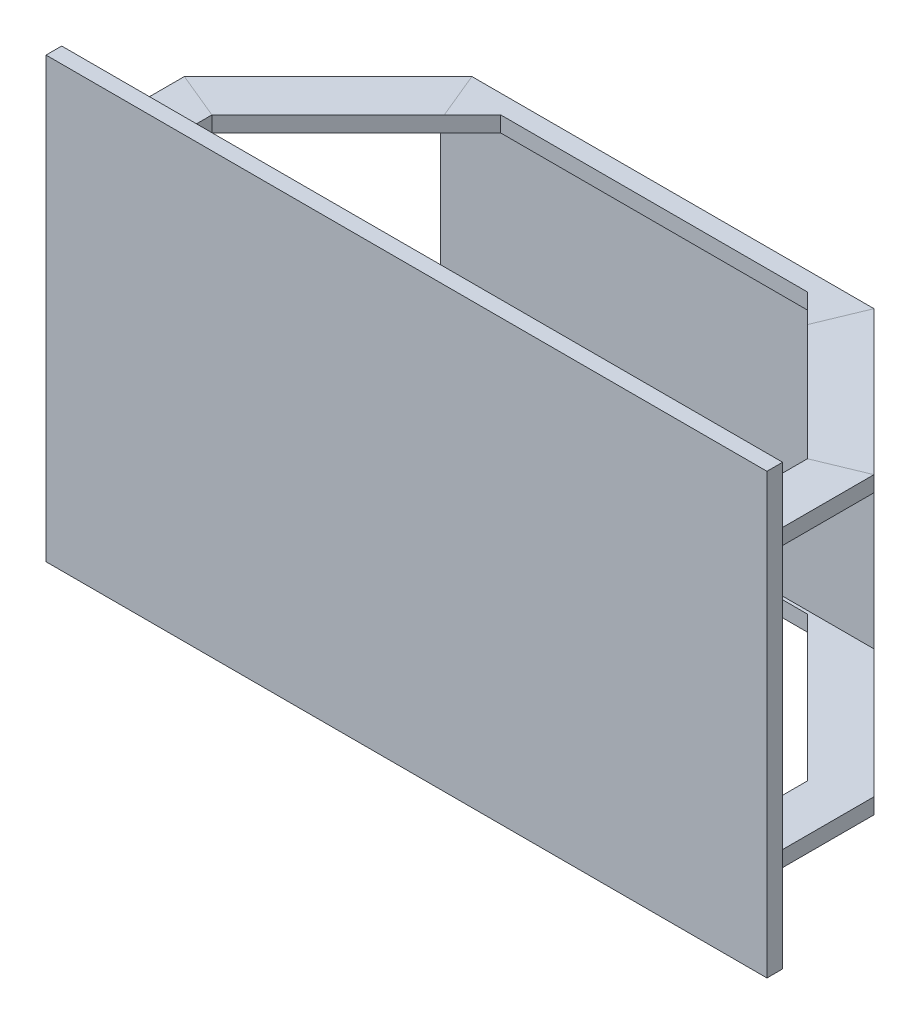
ISO-10303-21;
HEADER;
FILE_DESCRIPTION(('STEP AP214'),'2;1');
FILE_NAME('part.step','',(''),(''),'','','');
FILE_SCHEMA(('AUTOMOTIVE_DESIGN { 1 0 10303 214 1 1 1 1 }'));
ENDSEC;
DATA;
#1=APPLICATION_CONTEXT('core data for automotive mechanical design processes');
#2=APPLICATION_PROTOCOL_DEFINITION('international standard','automotive_design',2000,#1);
#3=PRODUCT_CONTEXT('',#1,'mechanical');
#4=PRODUCT('Part','Part','',(#3));
#5=PRODUCT_RELATED_PRODUCT_CATEGORY('part','',(#4));
#6=PRODUCT_DEFINITION_FORMATION('','',#4);
#7=PRODUCT_DEFINITION_CONTEXT('part definition',#1,'design');
#8=PRODUCT_DEFINITION('design','',#6,#7);
#9=PRODUCT_DEFINITION_SHAPE('','',#8);
#10=(LENGTH_UNIT() NAMED_UNIT(*) SI_UNIT(.MILLI.,.METRE.));
#11=(NAMED_UNIT(*) PLANE_ANGLE_UNIT() SI_UNIT($,.RADIAN.));
#12=(NAMED_UNIT(*) SI_UNIT($,.STERADIAN.) SOLID_ANGLE_UNIT());
#13=UNCERTAINTY_MEASURE_WITH_UNIT(LENGTH_MEASURE(1.E-05),#10,'distance_accuracy_value','');
#14=(GEOMETRIC_REPRESENTATION_CONTEXT(3) GLOBAL_UNCERTAINTY_ASSIGNED_CONTEXT((#13)) GLOBAL_UNIT_ASSIGNED_CONTEXT((#10,
#11,#12)) REPRESENTATION_CONTEXT('',''));
#15=CARTESIAN_POINT('',(0.,0.,0.));
#16=DIRECTION('',(0.,0.,1.));
#17=DIRECTION('',(1.,0.,0.));
#18=AXIS2_PLACEMENT_3D('',#15,#16,#17);
#19=CARTESIAN_POINT('',(53.1719300090006,47.,-69.7570021791339));
#20=DIRECTION('',(0.707106781186548,0.,-0.707106781186547));
#21=DIRECTION('',(-0.707106781186547,0.,-0.707106781186548));
#22=AXIS2_PLACEMENT_3D('',#19,#20,#21);
#23=PLANE('',#22);
#24=DIRECTION('',(0.,-1.,0.));
#25=VECTOR('',#24,1.);
#26=CARTESIAN_POINT('',(95.,47.,-27.9289321881345));
#27=LINE('',#26,#25);
#28=CARTESIAN_POINT('',(95.,-42.,-27.9289321881345));
#29=VERTEX_POINT('',#28);
#30=CARTESIAN_POINT('',(95.,-47.,-27.9289321881345));
#31=VERTEX_POINT('',#30);
#32=EDGE_CURVE('E406',#29,#31,#27,.T.);
#33=ORIENTED_EDGE('',*,*,#32,.F.);
#34=DIRECTION('',(-0.707106781186547,0.,-0.707106781186548));
#35=VECTOR('',#34,1.);
#36=CARTESIAN_POINT('',(53.1719300090007,-42.,-69.7570021791339));
#37=LINE('',#36,#35);
#38=CARTESIAN_POINT('',(48.9289321881346,-42.,-74.));
#39=VERTEX_POINT('',#38);
#40=EDGE_CURVE('E286',#29,#39,#37,.T.);
#41=ORIENTED_EDGE('',*,*,#40,.T.);
#42=DIRECTION('',(0.,1.,0.));
#43=VECTOR('',#42,1.);
#44=CARTESIAN_POINT('',(48.9289321881346,-70.,-74.));
#45=LINE('',#44,#43);
#46=CARTESIAN_POINT('',(48.9289321881346,-47.,-74.));
#47=VERTEX_POINT('',#46);
#48=EDGE_CURVE('E326',#47,#39,#45,.T.);
#49=ORIENTED_EDGE('',*,*,#48,.F.);
#50=DIRECTION('',(-0.707106781186547,0.,-0.707106781186548));
#51=VECTOR('',#50,1.);
#52=CARTESIAN_POINT('',(-10.8637084989846,-47.,-133.792640687119));
#53=LINE('',#52,#51);
#54=CARTESIAN_POINT('',(57.9289321881346,-47.,-65.));
#55=VERTEX_POINT('',#54);
#56=EDGE_CURVE('E477',#55,#47,#53,.T.);
#57=ORIENTED_EDGE('',*,*,#56,.F.);
#58=DIRECTION('',(0.707106781186547,0.,0.707106781186548));
#59=VECTOR('',#58,1.);
#60=CARTESIAN_POINT('',(53.1719300090006,-47.,-69.7570021791339));
#61=LINE('',#60,#59);
#62=EDGE_CURVE('E413',#55,#31,#61,.T.);
#63=ORIENTED_EDGE('',*,*,#62,.T.);
#64=EDGE_LOOP('',(#33,#41,#49,#57,#63));
#65=FACE_BOUND('',#64,.T.);
#66=ADVANCED_FACE('F35',(#65),#23,.F.);
#67=CARTESIAN_POINT('',(-99.7570021791339,47.,-23.1719300090006));
#68=DIRECTION('',(-0.707106781186548,0.,-0.707106781186547));
#69=DIRECTION('',(-0.707106781186547,0.,0.707106781186548));
#70=AXIS2_PLACEMENT_3D('',#67,#68,#69);
#71=PLANE('',#70);
#72=DIRECTION('',(0.,1.,0.));
#73=VECTOR('',#72,1.);
#74=CARTESIAN_POINT('',(-48.9289321881346,-70.,-74.));
#75=LINE('',#74,#73);
#76=CARTESIAN_POINT('',(-48.9289321881346,-47.,-74.));
#77=VERTEX_POINT('',#76);
#78=CARTESIAN_POINT('',(-48.9289321881346,-42.,-74.));
#79=VERTEX_POINT('',#78);
#80=EDGE_CURVE('E321',#77,#79,#75,.T.);
#81=ORIENTED_EDGE('',*,*,#80,.T.);
#82=DIRECTION('',(-0.707106781186547,0.,0.707106781186548));
#83=VECTOR('',#82,1.);
#84=CARTESIAN_POINT('',(-99.7570021791339,-42.,-23.1719300090006));
#85=LINE('',#84,#83);
#86=CARTESIAN_POINT('',(-95.,-42.,-27.9289321881345));
#87=VERTEX_POINT('',#86);
#88=EDGE_CURVE('E283',#79,#87,#85,.T.);
#89=ORIENTED_EDGE('',*,*,#88,.T.);
#90=DIRECTION('',(0.,-1.,0.));
#91=VECTOR('',#90,1.);
#92=CARTESIAN_POINT('',(-95.,47.,-27.9289321881345));
#93=LINE('',#92,#91);
#94=CARTESIAN_POINT('',(-95.,-47.,-27.9289321881345));
#95=VERTEX_POINT('',#94);
#96=EDGE_CURVE('E339',#87,#95,#93,.T.);
#97=ORIENTED_EDGE('',*,*,#96,.T.);
#98=DIRECTION('',(0.707106781186547,0.,-0.707106781186548));
#99=VECTOR('',#98,1.);
#100=CARTESIAN_POINT('',(-99.7570021791339,-47.,-23.1719300090006));
#101=LINE('',#100,#99);
#102=CARTESIAN_POINT('',(-57.9289321881345,-47.,-65.0000000000001));
#103=VERTEX_POINT('',#102);
#104=EDGE_CURVE('E375',#95,#103,#101,.T.);
#105=ORIENTED_EDGE('',*,*,#104,.T.);
#106=DIRECTION('',(-0.707106781186547,0.,0.707106781186548));
#107=VECTOR('',#106,1.);
#108=CARTESIAN_POINT('',(-53.7926406871193,-47.,-69.1362915010153));
#109=LINE('',#108,#107);
#110=EDGE_CURVE('E324',#77,#103,#109,.T.);
#111=ORIENTED_EDGE('',*,*,#110,.F.);
#112=EDGE_LOOP('',(#81,#89,#97,#105,#111));
#113=FACE_BOUND('',#112,.T.);
#114=ADVANCED_FACE('F491',(#113),#71,.F.);
#115=CARTESIAN_POINT('',(-48.9289321881346,-70.,-74.));
#116=DIRECTION('',(0.,0.,-1.));
#117=DIRECTION('',(0.,1.,0.));
#118=AXIS2_PLACEMENT_3D('',#115,#116,#117);
#119=PLANE('',#118);
#120=ORIENTED_EDGE('',*,*,#48,.T.);
#121=DIRECTION('',(-1.,0.,0.));
#122=VECTOR('',#121,1.);
#123=CARTESIAN_POINT('',(-48.9289321881346,-42.,-74.));
#124=LINE('',#123,#122);
#125=EDGE_CURVE('E43',#39,#79,#124,.T.);
#126=ORIENTED_EDGE('',*,*,#125,.T.);
#127=ORIENTED_EDGE('',*,*,#80,.F.);
#128=DIRECTION('',(-1.,0.,0.));
#129=VECTOR('',#128,1.);
#130=CARTESIAN_POINT('',(-64.6563491861041,-47.,-74.));
#131=LINE('',#130,#129);
#132=EDGE_CURVE('E480',#47,#77,#131,.T.);
#133=ORIENTED_EDGE('',*,*,#132,.F.);
#134=EDGE_LOOP('',(#120,#126,#127,#133));
#135=FACE_BOUND('',#134,.T.);
#136=ADVANCED_FACE('F488',(#135),#119,.F.);
#137=CARTESIAN_POINT('',(0.,0.,0.));
#138=DIRECTION('',(0.,0.,1.));
#139=DIRECTION('',(1.,0.,0.));
#140=AXIS2_PLACEMENT_3D('',#137,#138,#139);
#141=PLANE('',#140);
#142=DIRECTION('',(-1.,0.,0.));
#143=VECTOR('',#142,1.);
#144=CARTESIAN_POINT('',(-110.,47.,0.));
#145=LINE('',#144,#143);
#146=CARTESIAN_POINT('',(-95.,47.,0.));
#147=VERTEX_POINT('',#146);
#148=CARTESIAN_POINT('',(-110.,47.,0.));
#149=VERTEX_POINT('',#148);
#150=EDGE_CURVE('E355',#147,#149,#145,.T.);
#151=ORIENTED_EDGE('',*,*,#150,.T.);
#152=DIRECTION('',(0.,-1.,0.));
#153=VECTOR('',#152,1.);
#154=CARTESIAN_POINT('',(-110.,47.,0.));
#155=LINE('',#154,#153);
#156=CARTESIAN_POINT('',(-110.,-47.,0.));
#157=VERTEX_POINT('',#156);
#158=EDGE_CURVE('E344',#149,#157,#155,.T.);
#159=ORIENTED_EDGE('',*,*,#158,.T.);
#160=DIRECTION('',(1.,0.,0.));
#161=VECTOR('',#160,1.);
#162=CARTESIAN_POINT('',(-110.,-47.,0.));
#163=LINE('',#162,#161);
#164=CARTESIAN_POINT('',(-95.,-47.,0.));
#165=VERTEX_POINT('',#164);
#166=EDGE_CURVE('E346',#157,#165,#163,.T.);
#167=ORIENTED_EDGE('',*,*,#166,.T.);
#168=DIRECTION('',(0.,1.,0.));
#169=VECTOR('',#168,1.);
#170=CARTESIAN_POINT('',(-95.,47.,0.));
#171=LINE('',#170,#169);
#172=EDGE_CURVE('E357',#165,#147,#171,.T.);
#173=ORIENTED_EDGE('',*,*,#172,.T.);
#174=EDGE_LOOP('',(#151,#159,#167,#173));
#175=FACE_BOUND('',#174,.T.);
#176=DIRECTION('',(0.,-1.,0.));
#177=VECTOR('',#176,1.);
#178=CARTESIAN_POINT('',(-115.,70.,0.));
#179=LINE('',#178,#177);
#180=CARTESIAN_POINT('',(-115.,70.,0.));
#181=VERTEX_POINT('',#180);
#182=CARTESIAN_POINT('',(-115.,-70.,0.));
#183=VERTEX_POINT('',#182);
#184=EDGE_CURVE('E335',#181,#183,#179,.T.);
#185=ORIENTED_EDGE('',*,*,#184,.F.);
#186=DIRECTION('',(-1.,0.,0.));
#187=VECTOR('',#186,1.);
#188=CARTESIAN_POINT('',(-115.,70.,0.));
#189=LINE('',#188,#187);
#190=CARTESIAN_POINT('',(115.,70.,0.));
#191=VERTEX_POINT('',#190);
#192=EDGE_CURVE('E452',#191,#181,#189,.T.);
#193=ORIENTED_EDGE('',*,*,#192,.F.);
#194=DIRECTION('',(0.,1.,0.));
#195=VECTOR('',#194,1.);
#196=CARTESIAN_POINT('',(115.,70.,0.));
#197=LINE('',#196,#195);
#198=CARTESIAN_POINT('',(115.,-70.,0.));
#199=VERTEX_POINT('',#198);
#200=EDGE_CURVE('E463',#199,#191,#197,.T.);
#201=ORIENTED_EDGE('',*,*,#200,.F.);
#202=DIRECTION('',(1.,0.,0.));
#203=VECTOR('',#202,1.);
#204=CARTESIAN_POINT('',(-115.,-70.,0.));
#205=LINE('',#204,#203);
#206=EDGE_CURVE('E461',#183,#199,#205,.T.);
#207=ORIENTED_EDGE('',*,*,#206,.F.);
#208=EDGE_LOOP('',(#185,#193,#201,#207));
#209=FACE_BOUND('',#208,.T.);
#210=DIRECTION('',(0.,-1.,0.));
#211=VECTOR('',#210,1.);
#212=CARTESIAN_POINT('',(110.,47.,0.));
#213=LINE('',#212,#211);
#214=CARTESIAN_POINT('',(110.,47.,0.));
#215=VERTEX_POINT('',#214);
#216=CARTESIAN_POINT('',(110.,-47.,0.));
#217=VERTEX_POINT('',#216);
#218=EDGE_CURVE('E434',#215,#217,#213,.T.);
#219=ORIENTED_EDGE('',*,*,#218,.F.);
#220=DIRECTION('',(1.,0.,0.));
#221=VECTOR('',#220,1.);
#222=CARTESIAN_POINT('',(110.,47.,0.));
#223=LINE('',#222,#221);
#224=CARTESIAN_POINT('',(95.,47.,0.));
#225=VERTEX_POINT('',#224);
#226=EDGE_CURVE('E331',#225,#215,#223,.T.);
#227=ORIENTED_EDGE('',*,*,#226,.F.);
#228=DIRECTION('',(0.,1.,0.));
#229=VECTOR('',#228,1.);
#230=CARTESIAN_POINT('',(95.,47.,0.));
#231=LINE('',#230,#229);
#232=CARTESIAN_POINT('',(95.,-47.,0.));
#233=VERTEX_POINT('',#232);
#234=EDGE_CURVE('E428',#233,#225,#231,.T.);
#235=ORIENTED_EDGE('',*,*,#234,.F.);
#236=DIRECTION('',(-1.,0.,0.));
#237=VECTOR('',#236,1.);
#238=CARTESIAN_POINT('',(110.,-47.,0.));
#239=LINE('',#238,#237);
#240=EDGE_CURVE('E431',#217,#233,#239,.T.);
#241=ORIENTED_EDGE('',*,*,#240,.F.);
#242=EDGE_LOOP('',(#219,#227,#235,#241));
#243=FACE_BOUND('',#242,.T.);
#244=ADVANCED_FACE('F566',(#175,#209,#243),#141,.F.);
#245=CARTESIAN_POINT('',(-115.,70.,5.));
#246=DIRECTION('',(1.,0.,0.));
#247=DIRECTION('',(0.,0.,-1.));
#248=AXIS2_PLACEMENT_3D('',#245,#246,#247);
#249=PLANE('',#248);
#250=ORIENTED_EDGE('',*,*,#184,.T.);
#251=DIRECTION('',(0.,0.,-1.));
#252=VECTOR('',#251,1.);
#253=CARTESIAN_POINT('',(-115.,-70.,5.));
#254=LINE('',#253,#252);
#255=CARTESIAN_POINT('',(-115.,-70.,5.));
#256=VERTEX_POINT('',#255);
#257=EDGE_CURVE('E474',#256,#183,#254,.T.);
#258=ORIENTED_EDGE('',*,*,#257,.F.);
#259=DIRECTION('',(0.,-1.,0.));
#260=VECTOR('',#259,1.);
#261=CARTESIAN_POINT('',(-115.,70.,5.));
#262=LINE('',#261,#260);
#263=CARTESIAN_POINT('',(-115.,70.,5.));
#264=VERTEX_POINT('',#263);
#265=EDGE_CURVE('E448',#264,#256,#262,.T.);
#266=ORIENTED_EDGE('',*,*,#265,.F.);
#267=DIRECTION('',(0.,0.,-1.));
#268=VECTOR('',#267,1.);
#269=CARTESIAN_POINT('',(-115.,70.,5.));
#270=LINE('',#269,#268);
#271=EDGE_CURVE('E458',#264,#181,#270,.T.);
#272=ORIENTED_EDGE('',*,*,#271,.T.);
#273=EDGE_LOOP('',(#250,#258,#266,#272));
#274=FACE_BOUND('',#273,.T.);
#275=ADVANCED_FACE('F37',(#274),#249,.F.);
#276=CARTESIAN_POINT('',(-115.,-70.,5.));
#277=DIRECTION('',(0.,1.,0.));
#278=DIRECTION('',(0.,0.,1.));
#279=AXIS2_PLACEMENT_3D('',#276,#277,#278);
#280=PLANE('',#279);
#281=ORIENTED_EDGE('',*,*,#206,.T.);
#282=DIRECTION('',(0.,0.,-1.));
#283=VECTOR('',#282,1.);
#284=CARTESIAN_POINT('',(115.,-70.,5.));
#285=LINE('',#284,#283);
#286=CARTESIAN_POINT('',(115.,-70.,5.));
#287=VERTEX_POINT('',#286);
#288=EDGE_CURVE('E471',#287,#199,#285,.T.);
#289=ORIENTED_EDGE('',*,*,#288,.F.);
#290=DIRECTION('',(1.,0.,0.));
#291=VECTOR('',#290,1.);
#292=CARTESIAN_POINT('',(-115.,-70.,5.));
#293=LINE('',#292,#291);
#294=EDGE_CURVE('E451',#256,#287,#293,.T.);
#295=ORIENTED_EDGE('',*,*,#294,.F.);
#296=ORIENTED_EDGE('',*,*,#257,.T.);
#297=EDGE_LOOP('',(#281,#289,#295,#296));
#298=FACE_BOUND('',#297,.T.);
#299=ADVANCED_FACE('F575',(#298),#280,.F.);
#300=CARTESIAN_POINT('',(115.,70.,5.));
#301=DIRECTION('',(-1.,0.,0.));
#302=DIRECTION('',(0.,-1.,0.));
#303=AXIS2_PLACEMENT_3D('',#300,#301,#302);
#304=PLANE('',#303);
#305=ORIENTED_EDGE('',*,*,#200,.T.);
#306=DIRECTION('',(0.,0.,-1.));
#307=VECTOR('',#306,1.);
#308=CARTESIAN_POINT('',(115.,70.,5.));
#309=LINE('',#308,#307);
#310=CARTESIAN_POINT('',(115.,70.,5.));
#311=VERTEX_POINT('',#310);
#312=EDGE_CURVE('E468',#311,#191,#309,.T.);
#313=ORIENTED_EDGE('',*,*,#312,.F.);
#314=DIRECTION('',(0.,1.,0.));
#315=VECTOR('',#314,1.);
#316=CARTESIAN_POINT('',(115.,70.,5.));
#317=LINE('',#316,#315);
#318=EDGE_CURVE('E454',#287,#311,#317,.T.);
#319=ORIENTED_EDGE('',*,*,#318,.F.);
#320=ORIENTED_EDGE('',*,*,#288,.T.);
#321=EDGE_LOOP('',(#305,#313,#319,#320));
#322=FACE_BOUND('',#321,.T.);
#323=ADVANCED_FACE('F613',(#322),#304,.F.);
#324=CARTESIAN_POINT('',(-115.,70.,5.));
#325=DIRECTION('',(0.,-1.,0.));
#326=DIRECTION('',(1.,0.,0.));
#327=AXIS2_PLACEMENT_3D('',#324,#325,#326);
#328=PLANE('',#327);
#329=ORIENTED_EDGE('',*,*,#192,.T.);
#330=ORIENTED_EDGE('',*,*,#271,.F.);
#331=DIRECTION('',(-1.,0.,0.));
#332=VECTOR('',#331,1.);
#333=CARTESIAN_POINT('',(-115.,70.,5.));
#334=LINE('',#333,#332);
#335=EDGE_CURVE('E456',#311,#264,#334,.T.);
#336=ORIENTED_EDGE('',*,*,#335,.F.);
#337=ORIENTED_EDGE('',*,*,#312,.T.);
#338=EDGE_LOOP('',(#329,#330,#336,#337));
#339=FACE_BOUND('',#338,.T.);
#340=ADVANCED_FACE('F609',(#339),#328,.F.);
#341=CARTESIAN_POINT('',(0.,0.,5.));
#342=DIRECTION('',(0.,0.,1.));
#343=DIRECTION('',(1.,0.,0.));
#344=AXIS2_PLACEMENT_3D('',#341,#342,#343);
#345=PLANE('',#344);
#346=ORIENTED_EDGE('',*,*,#265,.T.);
#347=ORIENTED_EDGE('',*,*,#294,.T.);
#348=ORIENTED_EDGE('',*,*,#318,.T.);
#349=ORIENTED_EDGE('',*,*,#335,.T.);
#350=EDGE_LOOP('',(#346,#347,#348,#349));
#351=FACE_BOUND('',#350,.T.);
#352=ADVANCED_FACE('F604',(#351),#345,.T.);
#353=CARTESIAN_POINT('',(110.,47.,-34.656349186104));
#354=DIRECTION('',(-1.,0.,0.));
#355=DIRECTION('',(0.,0.,1.));
#356=AXIS2_PLACEMENT_3D('',#353,#354,#355);
#357=PLANE('',#356);
#358=DIRECTION('',(0.,1.,0.));
#359=VECTOR('',#358,1.);
#360=CARTESIAN_POINT('',(110.,47.,-34.1421356237309));
#361=LINE('',#360,#359);
#362=CARTESIAN_POINT('',(110.,-47.,-34.1421356237309));
#363=VERTEX_POINT('',#362);
#364=CARTESIAN_POINT('',(110.,-42.,-34.1421356237309));
#365=VERTEX_POINT('',#364);
#366=EDGE_CURVE('E410',#363,#365,#361,.T.);
#367=ORIENTED_EDGE('',*,*,#366,.T.);
#368=DIRECTION('',(0.,0.,1.));
#369=VECTOR('',#368,1.);
#370=CARTESIAN_POINT('',(110.,-42.,-34.656349186104));
#371=LINE('',#370,#369);
#372=CARTESIAN_POINT('',(110.,-42.,-2.99999999999999));
#373=VERTEX_POINT('',#372);
#374=EDGE_CURVE('E298',#365,#373,#371,.T.);
#375=ORIENTED_EDGE('',*,*,#374,.T.);
#376=DIRECTION('',(0.,1.,0.));
#377=VECTOR('',#376,1.);
#378=CARTESIAN_POINT('',(110.,47.,-3.));
#379=LINE('',#378,#377);
#380=CARTESIAN_POINT('',(110.,42.,-3.));
#381=VERTEX_POINT('',#380);
#382=EDGE_CURVE('E305',#373,#381,#379,.T.);
#383=ORIENTED_EDGE('',*,*,#382,.T.);
#384=DIRECTION('',(0.,0.,-1.));
#385=VECTOR('',#384,1.);
#386=CARTESIAN_POINT('',(110.,42.,-34.656349186104));
#387=LINE('',#386,#385);
#388=CARTESIAN_POINT('',(110.,42.,-34.1421356237309));
#389=VERTEX_POINT('',#388);
#390=EDGE_CURVE('E280',#381,#389,#387,.T.);
#391=ORIENTED_EDGE('',*,*,#390,.T.);
#392=CARTESIAN_POINT('',(110.,47.,-34.1421356237309));
#393=VERTEX_POINT('',#392);
#394=EDGE_CURVE('E423',#389,#393,#361,.T.);
#395=ORIENTED_EDGE('',*,*,#394,.T.);
#396=DIRECTION('',(0.,0.,1.));
#397=VECTOR('',#396,1.);
#398=CARTESIAN_POINT('',(110.,47.,-34.656349186104));
#399=LINE('',#398,#397);
#400=EDGE_CURVE('E414',#393,#215,#399,.T.);
#401=ORIENTED_EDGE('',*,*,#400,.T.);
#402=ORIENTED_EDGE('',*,*,#218,.T.);
#403=DIRECTION('',(0.,0.,1.));
#404=VECTOR('',#403,1.);
#405=CARTESIAN_POINT('',(110.,-47.,-34.656349186104));
#406=LINE('',#405,#404);
#407=EDGE_CURVE('E443',#363,#217,#406,.T.);
#408=ORIENTED_EDGE('',*,*,#407,.F.);
#409=EDGE_LOOP('',(#367,#375,#383,#391,#395,#401,#402,#408));
#410=FACE_BOUND('',#409,.T.);
#411=ADVANCED_FACE('F527',(#410),#357,.F.);
#412=CARTESIAN_POINT('',(110.,-47.,-34.656349186104));
#413=DIRECTION('',(0.,1.,0.));
#414=DIRECTION('',(-1.,0.,0.));
#415=AXIS2_PLACEMENT_3D('',#412,#413,#414);
#416=PLANE('',#415);
#417=DIRECTION('',(0.923879532511287,0.,-0.38268343236509));
#418=VECTOR('',#417,1.);
#419=CARTESIAN_POINT('',(86.8892658633994,-47.,-24.5693561079521));
#420=LINE('',#419,#418);
#421=EDGE_CURVE('E396',#31,#363,#420,.T.);
#422=ORIENTED_EDGE('',*,*,#421,.T.);
#423=ORIENTED_EDGE('',*,*,#407,.T.);
#424=ORIENTED_EDGE('',*,*,#240,.T.);
#425=DIRECTION('',(0.,0.,1.));
#426=VECTOR('',#425,1.);
#427=CARTESIAN_POINT('',(95.,-47.,-34.656349186104));
#428=LINE('',#427,#426);
#429=EDGE_CURVE('E440',#31,#233,#428,.T.);
#430=ORIENTED_EDGE('',*,*,#429,.F.);
#431=EDGE_LOOP('',(#422,#423,#424,#430));
#432=FACE_BOUND('',#431,.T.);
#433=ADVANCED_FACE('F542',(#432),#416,.F.);
#434=CARTESIAN_POINT('',(95.,47.,-34.656349186104));
#435=DIRECTION('',(1.,0.,0.));
#436=DIRECTION('',(0.,0.,-1.));
#437=AXIS2_PLACEMENT_3D('',#434,#435,#436);
#438=PLANE('',#437);
#439=DIRECTION('',(0.,-1.,0.));
#440=VECTOR('',#439,1.);
#441=CARTESIAN_POINT('',(95.,47.,-3.));
#442=LINE('',#441,#440);
#443=CARTESIAN_POINT('',(95.,42.,-3.));
#444=VERTEX_POINT('',#443);
#445=CARTESIAN_POINT('',(95.,-42.,-2.99999999999999));
#446=VERTEX_POINT('',#445);
#447=EDGE_CURVE('E302',#444,#446,#442,.T.);
#448=ORIENTED_EDGE('',*,*,#447,.T.);
#449=DIRECTION('',(0.,0.,-1.));
#450=VECTOR('',#449,1.);
#451=CARTESIAN_POINT('',(95.,-42.,-34.656349186104));
#452=LINE('',#451,#450);
#453=EDGE_CURVE('E289',#446,#29,#452,.T.);
#454=ORIENTED_EDGE('',*,*,#453,.T.);
#455=ORIENTED_EDGE('',*,*,#32,.T.);
#456=ORIENTED_EDGE('',*,*,#429,.T.);
#457=ORIENTED_EDGE('',*,*,#234,.T.);
#458=DIRECTION('',(0.,0.,1.));
#459=VECTOR('',#458,1.);
#460=CARTESIAN_POINT('',(95.,47.,-34.656349186104));
#461=LINE('',#460,#459);
#462=CARTESIAN_POINT('',(95.,47.,-27.9289321881345));
#463=VERTEX_POINT('',#462);
#464=EDGE_CURVE('E437',#463,#225,#461,.T.);
#465=ORIENTED_EDGE('',*,*,#464,.F.);
#466=CARTESIAN_POINT('',(95.,42.,-27.9289321881345));
#467=VERTEX_POINT('',#466);
#468=EDGE_CURVE('E403',#463,#467,#27,.T.);
#469=ORIENTED_EDGE('',*,*,#468,.T.);
#470=DIRECTION('',(0.,0.,1.));
#471=VECTOR('',#470,1.);
#472=CARTESIAN_POINT('',(95.,42.,-34.656349186104));
#473=LINE('',#472,#471);
#474=EDGE_CURVE('E268',#467,#444,#473,.T.);
#475=ORIENTED_EDGE('',*,*,#474,.T.);
#476=EDGE_LOOP('',(#448,#454,#455,#456,#457,#465,#469,#475));
#477=FACE_BOUND('',#476,.T.);
#478=ADVANCED_FACE('F519',(#477),#438,.F.);
#479=CARTESIAN_POINT('',(110.,47.,-34.656349186104));
#480=DIRECTION('',(0.,-1.,0.));
#481=DIRECTION('',(1.,0.,0.));
#482=AXIS2_PLACEMENT_3D('',#479,#480,#481);
#483=PLANE('',#482);
#484=DIRECTION('',(-0.923879532511287,0.,0.38268343236509));
#485=VECTOR('',#484,1.);
#486=CARTESIAN_POINT('',(86.8892658633994,47.,-24.5693561079521));
#487=LINE('',#486,#485);
#488=EDGE_CURVE('E407',#393,#463,#487,.T.);
#489=ORIENTED_EDGE('',*,*,#488,.T.);
#490=ORIENTED_EDGE('',*,*,#464,.T.);
#491=ORIENTED_EDGE('',*,*,#226,.T.);
#492=ORIENTED_EDGE('',*,*,#400,.F.);
#493=EDGE_LOOP('',(#489,#490,#491,#492));
#494=FACE_BOUND('',#493,.T.);
#495=ADVANCED_FACE('F538',(#494),#483,.F.);
#496=CARTESIAN_POINT('',(63.7785317267989,47.,-80.3636038969321));
#497=DIRECTION('',(0.,-1.,0.));
#498=DIRECTION('',(1.,0.,0.));
#499=AXIS2_PLACEMENT_3D('',#496,#497,#498);
#500=PLANE('',#499);
#501=DIRECTION('',(0.707106781186547,0.,0.707106781186548));
#502=VECTOR('',#501,1.);
#503=CARTESIAN_POINT('',(63.7785317267989,47.,-80.3636038969321));
#504=LINE('',#503,#502);
#505=CARTESIAN_POINT('',(64.142135623731,47.,-80.));
#506=VERTEX_POINT('',#505);
#507=EDGE_CURVE('E420',#506,#393,#504,.T.);
#508=ORIENTED_EDGE('',*,*,#507,.F.);
#509=DIRECTION('',(-0.38268343236509,0.,0.923879532511287));
#510=VECTOR('',#509,1.);
#511=CARTESIAN_POINT('',(45.2800342266069,47.,-34.4628589922065));
#512=LINE('',#511,#510);
#513=CARTESIAN_POINT('',(57.9289321881345,47.,-65.));
#514=VERTEX_POINT('',#513);
#515=EDGE_CURVE('E388',#506,#514,#512,.T.);
#516=ORIENTED_EDGE('',*,*,#515,.T.);
#517=DIRECTION('',(0.707106781186547,0.,0.707106781186548));
#518=VECTOR('',#517,1.);
#519=CARTESIAN_POINT('',(53.1719300090006,47.,-69.7570021791339));
#520=LINE('',#519,#518);
#521=EDGE_CURVE('E411',#514,#463,#520,.T.);
#522=ORIENTED_EDGE('',*,*,#521,.T.);
#523=ORIENTED_EDGE('',*,*,#488,.F.);
#524=EDGE_LOOP('',(#508,#516,#522,#523));
#525=FACE_BOUND('',#524,.T.);
#526=ADVANCED_FACE('F533',(#525),#500,.F.);
#527=CARTESIAN_POINT('',(48.9289321881346,42.,-74.));
#528=VERTEX_POINT('',#527);
#529=CARTESIAN_POINT('',(48.9289321881346,47.,-74.));
#530=VERTEX_POINT('',#529);
#531=EDGE_CURVE('E320',#528,#530,#45,.T.);
#532=ORIENTED_EDGE('',*,*,#531,.F.);
#533=DIRECTION('',(0.707106781186547,0.,0.707106781186548));
#534=VECTOR('',#533,1.);
#535=CARTESIAN_POINT('',(53.1719300090006,42.,-69.7570021791339));
#536=LINE('',#535,#534);
#537=EDGE_CURVE('E265',#528,#467,#536,.T.);
#538=ORIENTED_EDGE('',*,*,#537,.T.);
#539=ORIENTED_EDGE('',*,*,#468,.F.);
#540=ORIENTED_EDGE('',*,*,#521,.F.);
#541=DIRECTION('',(-0.707106781186547,0.,-0.707106781186548));
#542=VECTOR('',#541,1.);
#543=CARTESIAN_POINT('',(48.9289321881346,47.,-74.));
#544=LINE('',#543,#542);
#545=EDGE_CURVE('E311',#514,#530,#544,.T.);
#546=ORIENTED_EDGE('',*,*,#545,.T.);
#547=EDGE_LOOP('',(#532,#538,#539,#540,#546));
#548=FACE_BOUND('',#547,.T.);
#549=ADVANCED_FACE('F564',(#548),#23,.F.);
#550=CARTESIAN_POINT('',(63.7785317267989,-47.,-80.3636038969321));
#551=DIRECTION('',(0.,1.,0.));
#552=DIRECTION('',(-1.,0.,0.));
#553=AXIS2_PLACEMENT_3D('',#550,#551,#552);
#554=PLANE('',#553);
#555=ORIENTED_EDGE('',*,*,#62,.F.);
#556=DIRECTION('',(0.38268343236509,0.,-0.923879532511287));
#557=VECTOR('',#556,1.);
#558=CARTESIAN_POINT('',(45.2800342266069,-47.,-34.4628589922065));
#559=LINE('',#558,#557);
#560=CARTESIAN_POINT('',(64.142135623731,-47.,-80.));
#561=VERTEX_POINT('',#560);
#562=EDGE_CURVE('E376',#55,#561,#559,.T.);
#563=ORIENTED_EDGE('',*,*,#562,.T.);
#564=DIRECTION('',(0.707106781186547,0.,0.707106781186548));
#565=VECTOR('',#564,1.);
#566=CARTESIAN_POINT('',(63.7785317267989,-47.,-80.3636038969321));
#567=LINE('',#566,#565);
#568=EDGE_CURVE('E417',#561,#363,#567,.T.);
#569=ORIENTED_EDGE('',*,*,#568,.T.);
#570=ORIENTED_EDGE('',*,*,#421,.F.);
#571=EDGE_LOOP('',(#555,#563,#569,#570));
#572=FACE_BOUND('',#571,.T.);
#573=ADVANCED_FACE('F512',(#572),#554,.F.);
#574=CARTESIAN_POINT('',(63.7785317267989,47.,-80.3636038969321));
#575=DIRECTION('',(-0.707106781186548,0.,0.707106781186547));
#576=DIRECTION('',(0.707106781186547,0.,0.707106781186548));
#577=AXIS2_PLACEMENT_3D('',#574,#575,#576);
#578=PLANE('',#577);
#579=DIRECTION('',(0.,-1.,0.));
#580=VECTOR('',#579,1.);
#581=CARTESIAN_POINT('',(69.142135623731,47.,-75.));
#582=LINE('',#581,#580);
#583=CARTESIAN_POINT('',(69.142135623731,42.,-75.));
#584=VERTEX_POINT('',#583);
#585=CARTESIAN_POINT('',(69.142135623731,-42.,-75.));
#586=VERTEX_POINT('',#585);
#587=EDGE_CURVE('E308',#584,#586,#582,.T.);
#588=ORIENTED_EDGE('',*,*,#587,.T.);
#589=DIRECTION('',(0.707106781186547,0.,0.707106781186548));
#590=VECTOR('',#589,1.);
#591=CARTESIAN_POINT('',(63.7785317267989,-42.,-80.3636038969321));
#592=LINE('',#591,#590);
#593=EDGE_CURVE('E295',#586,#365,#592,.T.);
#594=ORIENTED_EDGE('',*,*,#593,.T.);
#595=ORIENTED_EDGE('',*,*,#366,.F.);
#596=ORIENTED_EDGE('',*,*,#568,.F.);
#597=DIRECTION('',(0.,1.,0.));
#598=VECTOR('',#597,1.);
#599=CARTESIAN_POINT('',(64.142135623731,47.,-80.));
#600=LINE('',#599,#598);
#601=EDGE_CURVE('E391',#561,#506,#600,.T.);
#602=ORIENTED_EDGE('',*,*,#601,.T.);
#603=ORIENTED_EDGE('',*,*,#507,.T.);
#604=ORIENTED_EDGE('',*,*,#394,.F.);
#605=DIRECTION('',(-0.707106781186547,0.,-0.707106781186548));
#606=VECTOR('',#605,1.);
#607=CARTESIAN_POINT('',(63.7785317267989,42.,-80.3636038969321));
#608=LINE('',#607,#606);
#609=EDGE_CURVE('E277',#389,#584,#608,.T.);
#610=ORIENTED_EDGE('',*,*,#609,.T.);
#611=EDGE_LOOP('',(#588,#594,#595,#596,#602,#603,#604,#610));
#612=FACE_BOUND('',#611,.T.);
#613=ADVANCED_FACE('F530',(#612),#578,.F.);
#614=CARTESIAN_POINT('',(-64.6563491861041,47.,-80.));
#615=DIRECTION('',(0.,-1.,0.));
#616=DIRECTION('',(0.,0.,-1.));
#617=AXIS2_PLACEMENT_3D('',#614,#615,#616);
#618=PLANE('',#617);
#619=DIRECTION('',(0.38268343236509,0.,0.923879532511287));
#620=VECTOR('',#619,1.);
#621=CARTESIAN_POINT('',(-54.5693561079521,47.,-56.8892658633994));
#622=LINE('',#621,#620);
#623=CARTESIAN_POINT('',(-64.142135623731,47.,-80.));
#624=VERTEX_POINT('',#623);
#625=CARTESIAN_POINT('',(-57.9289321881345,47.,-65.));
#626=VERTEX_POINT('',#625);
#627=EDGE_CURVE('E369',#624,#626,#622,.T.);
#628=ORIENTED_EDGE('',*,*,#627,.T.);
#629=DIRECTION('',(-0.707106781186547,0.,0.707106781186548));
#630=VECTOR('',#629,1.);
#631=CARTESIAN_POINT('',(-48.9289321881346,47.,-74.));
#632=LINE('',#631,#630);
#633=CARTESIAN_POINT('',(-48.9289321881346,47.,-74.));
#634=VERTEX_POINT('',#633);
#635=EDGE_CURVE('E317',#634,#626,#632,.T.);
#636=ORIENTED_EDGE('',*,*,#635,.F.);
#637=DIRECTION('',(-1.,0.,0.));
#638=VECTOR('',#637,1.);
#639=CARTESIAN_POINT('',(-48.9289321881346,47.,-74.));
#640=LINE('',#639,#638);
#641=EDGE_CURVE('E314',#530,#634,#640,.T.);
#642=ORIENTED_EDGE('',*,*,#641,.F.);
#643=ORIENTED_EDGE('',*,*,#545,.F.);
#644=ORIENTED_EDGE('',*,*,#515,.F.);
#645=DIRECTION('',(1.,0.,0.));
#646=VECTOR('',#645,1.);
#647=CARTESIAN_POINT('',(-64.6563491861041,47.,-80.));
#648=LINE('',#647,#646);
#649=EDGE_CURVE('E395',#624,#506,#648,.T.);
#650=ORIENTED_EDGE('',*,*,#649,.F.);
#651=EDGE_LOOP('',(#628,#636,#642,#643,#644,#650));
#652=FACE_BOUND('',#651,.T.);
#653=ADVANCED_FACE('F560',(#652),#618,.F.);
#654=CARTESIAN_POINT('',(-64.6563491861041,-47.,-80.));
#655=DIRECTION('',(0.,1.,0.));
#656=DIRECTION('',(0.,0.,1.));
#657=AXIS2_PLACEMENT_3D('',#654,#655,#656);
#658=PLANE('',#657);
#659=ORIENTED_EDGE('',*,*,#132,.T.);
#660=ORIENTED_EDGE('',*,*,#110,.T.);
#661=DIRECTION('',(-0.38268343236509,0.,-0.923879532511287));
#662=VECTOR('',#661,1.);
#663=CARTESIAN_POINT('',(-54.5693561079521,-47.,-56.8892658633994));
#664=LINE('',#663,#662);
#665=CARTESIAN_POINT('',(-64.142135623731,-47.,-80.));
#666=VERTEX_POINT('',#665);
#667=EDGE_CURVE('E347',#103,#666,#664,.T.);
#668=ORIENTED_EDGE('',*,*,#667,.T.);
#669=DIRECTION('',(1.,0.,0.));
#670=VECTOR('',#669,1.);
#671=CARTESIAN_POINT('',(-64.6563491861041,-47.,-80.));
#672=LINE('',#671,#670);
#673=EDGE_CURVE('E392',#666,#561,#672,.T.);
#674=ORIENTED_EDGE('',*,*,#673,.T.);
#675=ORIENTED_EDGE('',*,*,#562,.F.);
#676=ORIENTED_EDGE('',*,*,#56,.T.);
#677=EDGE_LOOP('',(#659,#660,#668,#674,#675,#676));
#678=FACE_BOUND('',#677,.T.);
#679=ADVANCED_FACE('F496',(#678),#658,.F.);
#680=CARTESIAN_POINT('',(-64.6563491861041,47.,-80.));
#681=DIRECTION('',(0.,0.,1.));
#682=DIRECTION('',(1.,0.,0.));
#683=AXIS2_PLACEMENT_3D('',#680,#681,#682);
#684=PLANE('',#683);
#685=ORIENTED_EDGE('',*,*,#673,.F.);
#686=DIRECTION('',(0.,1.,0.));
#687=VECTOR('',#686,1.);
#688=CARTESIAN_POINT('',(-64.142135623731,47.,-80.));
#689=LINE('',#688,#687);
#690=EDGE_CURVE('E372',#666,#624,#689,.T.);
#691=ORIENTED_EDGE('',*,*,#690,.T.);
#692=ORIENTED_EDGE('',*,*,#649,.T.);
#693=ORIENTED_EDGE('',*,*,#601,.F.);
#694=EDGE_LOOP('',(#685,#691,#692,#693));
#695=FACE_BOUND('',#694,.T.);
#696=ADVANCED_FACE('F506',(#695),#684,.F.);
#697=CARTESIAN_POINT('',(-110.363603896932,47.,-33.7785317267988));
#698=DIRECTION('',(0.,-1.,0.));
#699=DIRECTION('',(1.,0.,0.));
#700=AXIS2_PLACEMENT_3D('',#697,#698,#699);
#701=PLANE('',#700);
#702=DIRECTION('',(0.707106781186547,0.,-0.707106781186548));
#703=VECTOR('',#702,1.);
#704=CARTESIAN_POINT('',(-110.363603896932,47.,-33.7785317267988));
#705=LINE('',#704,#703);
#706=CARTESIAN_POINT('',(-110.,47.,-34.1421356237309));
#707=VERTEX_POINT('',#706);
#708=EDGE_CURVE('E381',#707,#624,#705,.T.);
#709=ORIENTED_EDGE('',*,*,#708,.F.);
#710=DIRECTION('',(0.923879532511287,0.,0.38268343236509));
#711=VECTOR('',#710,1.);
#712=CARTESIAN_POINT('',(-97.9289321881345,47.,-29.1421356237309));
#713=LINE('',#712,#711);
#714=CARTESIAN_POINT('',(-95.,47.,-27.9289321881345));
#715=VERTEX_POINT('',#714);
#716=EDGE_CURVE('E340',#707,#715,#713,.T.);
#717=ORIENTED_EDGE('',*,*,#716,.T.);
#718=DIRECTION('',(0.707106781186547,0.,-0.707106781186548));
#719=VECTOR('',#718,1.);
#720=CARTESIAN_POINT('',(-99.7570021791339,47.,-23.1719300090006));
#721=LINE('',#720,#719);
#722=EDGE_CURVE('E373',#715,#626,#721,.T.);
#723=ORIENTED_EDGE('',*,*,#722,.T.);
#724=ORIENTED_EDGE('',*,*,#627,.F.);
#725=EDGE_LOOP('',(#709,#717,#723,#724));
#726=FACE_BOUND('',#725,.T.);
#727=ADVANCED_FACE('F555',(#726),#701,.F.);
#728=CARTESIAN_POINT('',(-95.,42.,-27.9289321881345));
#729=VERTEX_POINT('',#728);
#730=EDGE_CURVE('E336',#715,#729,#93,.T.);
#731=ORIENTED_EDGE('',*,*,#730,.T.);
#732=DIRECTION('',(0.707106781186547,0.,-0.707106781186548));
#733=VECTOR('',#732,1.);
#734=CARTESIAN_POINT('',(-99.7570021791339,42.,-23.1719300090006));
#735=LINE('',#734,#733);
#736=CARTESIAN_POINT('',(-48.9289321881346,42.,-74.));
#737=VERTEX_POINT('',#736);
#738=EDGE_CURVE('E262',#729,#737,#735,.T.);
#739=ORIENTED_EDGE('',*,*,#738,.T.);
#740=EDGE_CURVE('E325',#737,#634,#75,.T.);
#741=ORIENTED_EDGE('',*,*,#740,.T.);
#742=ORIENTED_EDGE('',*,*,#635,.T.);
#743=ORIENTED_EDGE('',*,*,#722,.F.);
#744=EDGE_LOOP('',(#731,#739,#741,#742,#743));
#745=FACE_BOUND('',#744,.T.);
#746=ADVANCED_FACE('F589',(#745),#71,.F.);
#747=CARTESIAN_POINT('',(-110.363603896932,-47.,-33.7785317267988));
#748=DIRECTION('',(0.,1.,0.));
#749=DIRECTION('',(-1.,0.,0.));
#750=AXIS2_PLACEMENT_3D('',#747,#748,#749);
#751=PLANE('',#750);
#752=ORIENTED_EDGE('',*,*,#104,.F.);
#753=DIRECTION('',(-0.923879532511287,0.,-0.38268343236509));
#754=VECTOR('',#753,1.);
#755=CARTESIAN_POINT('',(-97.9289321881345,-47.,-29.1421356237309));
#756=LINE('',#755,#754);
#757=CARTESIAN_POINT('',(-110.,-47.,-34.1421356237309));
#758=VERTEX_POINT('',#757);
#759=EDGE_CURVE('E332',#95,#758,#756,.T.);
#760=ORIENTED_EDGE('',*,*,#759,.T.);
#761=DIRECTION('',(0.707106781186547,0.,-0.707106781186548));
#762=VECTOR('',#761,1.);
#763=CARTESIAN_POINT('',(-110.363603896932,-47.,-33.7785317267988));
#764=LINE('',#763,#762);
#765=EDGE_CURVE('E378',#758,#666,#764,.T.);
#766=ORIENTED_EDGE('',*,*,#765,.T.);
#767=ORIENTED_EDGE('',*,*,#667,.F.);
#768=EDGE_LOOP('',(#752,#760,#766,#767));
#769=FACE_BOUND('',#768,.T.);
#770=ADVANCED_FACE('F498',(#769),#751,.F.);
#771=CARTESIAN_POINT('',(-110.363603896932,47.,-33.7785317267988));
#772=DIRECTION('',(0.707106781186548,0.,0.707106781186547));
#773=DIRECTION('',(0.707106781186547,0.,-0.707106781186548));
#774=AXIS2_PLACEMENT_3D('',#771,#772,#773);
#775=PLANE('',#774);
#776=DIRECTION('',(0.,1.,0.));
#777=VECTOR('',#776,1.);
#778=CARTESIAN_POINT('',(-110.,47.,-34.1421356237309));
#779=LINE('',#778,#777);
#780=CARTESIAN_POINT('',(-110.,-42.,-34.1421356237309));
#781=VERTEX_POINT('',#780);
#782=EDGE_CURVE('E343',#758,#781,#779,.T.);
#783=ORIENTED_EDGE('',*,*,#782,.T.);
#784=DIRECTION('',(0.707106781186547,0.,-0.707106781186548));
#785=VECTOR('',#784,1.);
#786=CARTESIAN_POINT('',(-110.363603896932,-42.,-33.7785317267988));
#787=LINE('',#786,#785);
#788=CARTESIAN_POINT('',(-69.142135623731,-42.,-75.));
#789=VERTEX_POINT('',#788);
#790=EDGE_CURVE('E246',#781,#789,#787,.T.);
#791=ORIENTED_EDGE('',*,*,#790,.T.);
#792=DIRECTION('',(0.,1.,0.));
#793=VECTOR('',#792,1.);
#794=CARTESIAN_POINT('',(-69.142135623731,47.,-75.));
#795=LINE('',#794,#793);
#796=CARTESIAN_POINT('',(-69.1421356237309,42.,-75.));
#797=VERTEX_POINT('',#796);
#798=EDGE_CURVE('E11',#789,#797,#795,.T.);
#799=ORIENTED_EDGE('',*,*,#798,.T.);
#800=DIRECTION('',(-0.707106781186547,0.,0.707106781186548));
#801=VECTOR('',#800,1.);
#802=CARTESIAN_POINT('',(-110.363603896932,42.,-33.7785317267988));
#803=LINE('',#802,#801);
#804=CARTESIAN_POINT('',(-110.,42.,-34.1421356237309));
#805=VERTEX_POINT('',#804);
#806=EDGE_CURVE('E274',#797,#805,#803,.T.);
#807=ORIENTED_EDGE('',*,*,#806,.T.);
#808=EDGE_CURVE('E364',#805,#707,#779,.T.);
#809=ORIENTED_EDGE('',*,*,#808,.T.);
#810=ORIENTED_EDGE('',*,*,#708,.T.);
#811=ORIENTED_EDGE('',*,*,#690,.F.);
#812=ORIENTED_EDGE('',*,*,#765,.F.);
#813=EDGE_LOOP('',(#783,#791,#799,#807,#809,#810,#811,#812));
#814=FACE_BOUND('',#813,.T.);
#815=ADVANCED_FACE('F502',(#814),#775,.F.);
#816=CARTESIAN_POINT('',(-110.,47.,0.));
#817=DIRECTION('',(0.,-1.,0.));
#818=DIRECTION('',(1.,0.,0.));
#819=AXIS2_PLACEMENT_3D('',#816,#817,#818);
#820=PLANE('',#819);
#821=DIRECTION('',(0.,0.,-1.));
#822=VECTOR('',#821,1.);
#823=CARTESIAN_POINT('',(-110.,47.,0.));
#824=LINE('',#823,#822);
#825=EDGE_CURVE('E352',#149,#707,#824,.T.);
#826=ORIENTED_EDGE('',*,*,#825,.F.);
#827=ORIENTED_EDGE('',*,*,#150,.F.);
#828=DIRECTION('',(0.,0.,-1.));
#829=VECTOR('',#828,1.);
#830=CARTESIAN_POINT('',(-95.,47.,0.));
#831=LINE('',#830,#829);
#832=EDGE_CURVE('E360',#147,#715,#831,.T.);
#833=ORIENTED_EDGE('',*,*,#832,.T.);
#834=ORIENTED_EDGE('',*,*,#716,.F.);
#835=EDGE_LOOP('',(#826,#827,#833,#834));
#836=FACE_BOUND('',#835,.T.);
#837=ADVANCED_FACE('F552',(#836),#820,.F.);
#838=CARTESIAN_POINT('',(-95.,47.,0.));
#839=DIRECTION('',(-1.,0.,0.));
#840=DIRECTION('',(0.,0.,1.));
#841=AXIS2_PLACEMENT_3D('',#838,#839,#840);
#842=PLANE('',#841);
#843=ORIENTED_EDGE('',*,*,#96,.F.);
#844=DIRECTION('',(0.,0.,1.));
#845=VECTOR('',#844,1.);
#846=CARTESIAN_POINT('',(-95.,-42.,0.));
#847=LINE('',#846,#845);
#848=CARTESIAN_POINT('',(-95.,-42.,-2.99999999999999));
#849=VERTEX_POINT('',#848);
#850=EDGE_CURVE('E292',#87,#849,#847,.T.);
#851=ORIENTED_EDGE('',*,*,#850,.T.);
#852=DIRECTION('',(0.,1.,0.));
#853=VECTOR('',#852,1.);
#854=CARTESIAN_POINT('',(-95.,47.,-3.));
#855=LINE('',#854,#853);
#856=CARTESIAN_POINT('',(-95.,42.,-3.));
#857=VERTEX_POINT('',#856);
#858=EDGE_CURVE('E235',#849,#857,#855,.T.);
#859=ORIENTED_EDGE('',*,*,#858,.T.);
#860=DIRECTION('',(0.,0.,-1.));
#861=VECTOR('',#860,1.);
#862=CARTESIAN_POINT('',(-95.,42.,0.));
#863=LINE('',#862,#861);
#864=EDGE_CURVE('E271',#857,#729,#863,.T.);
#865=ORIENTED_EDGE('',*,*,#864,.T.);
#866=ORIENTED_EDGE('',*,*,#730,.F.);
#867=ORIENTED_EDGE('',*,*,#832,.F.);
#868=ORIENTED_EDGE('',*,*,#172,.F.);
#869=DIRECTION('',(0.,0.,-1.));
#870=VECTOR('',#869,1.);
#871=CARTESIAN_POINT('',(-95.,-47.,0.));
#872=LINE('',#871,#870);
#873=EDGE_CURVE('E351',#165,#95,#872,.T.);
#874=ORIENTED_EDGE('',*,*,#873,.T.);
#875=EDGE_LOOP('',(#843,#851,#859,#865,#866,#867,#868,#874));
#876=FACE_BOUND('',#875,.T.);
#877=ADVANCED_FACE('F623',(#876),#842,.F.);
#878=CARTESIAN_POINT('',(-110.,-47.,0.));
#879=DIRECTION('',(0.,1.,0.));
#880=DIRECTION('',(-1.,0.,0.));
#881=AXIS2_PLACEMENT_3D('',#878,#879,#880);
#882=PLANE('',#881);
#883=ORIENTED_EDGE('',*,*,#873,.F.);
#884=ORIENTED_EDGE('',*,*,#166,.F.);
#885=DIRECTION('',(0.,0.,-1.));
#886=VECTOR('',#885,1.);
#887=CARTESIAN_POINT('',(-110.,-47.,0.));
#888=LINE('',#887,#886);
#889=EDGE_CURVE('E348',#157,#758,#888,.T.);
#890=ORIENTED_EDGE('',*,*,#889,.T.);
#891=ORIENTED_EDGE('',*,*,#759,.F.);
#892=EDGE_LOOP('',(#883,#884,#890,#891));
#893=FACE_BOUND('',#892,.T.);
#894=ADVANCED_FACE('F616',(#893),#882,.F.);
#895=CARTESIAN_POINT('',(-110.,47.,0.));
#896=DIRECTION('',(1.,0.,0.));
#897=DIRECTION('',(0.,0.,-1.));
#898=AXIS2_PLACEMENT_3D('',#895,#896,#897);
#899=PLANE('',#898);
#900=DIRECTION('',(0.,1.,0.));
#901=VECTOR('',#900,1.);
#902=CARTESIAN_POINT('',(-110.,42.,-3.));
#903=LINE('',#902,#901);
#904=CARTESIAN_POINT('',(-110.,-42.,-2.99999999999999));
#905=VERTEX_POINT('',#904);
#906=CARTESIAN_POINT('',(-110.,42.,-3.));
#907=VERTEX_POINT('',#906);
#908=EDGE_CURVE('E58',#905,#907,#903,.T.);
#909=ORIENTED_EDGE('',*,*,#908,.F.);
#910=DIRECTION('',(0.,0.,1.));
#911=VECTOR('',#910,1.);
#912=CARTESIAN_POINT('',(-110.,-42.,-2.99999999999999));
#913=LINE('',#912,#911);
#914=EDGE_CURVE('E242',#781,#905,#913,.T.);
#915=ORIENTED_EDGE('',*,*,#914,.F.);
#916=ORIENTED_EDGE('',*,*,#782,.F.);
#917=ORIENTED_EDGE('',*,*,#889,.F.);
#918=ORIENTED_EDGE('',*,*,#158,.F.);
#919=ORIENTED_EDGE('',*,*,#825,.T.);
#920=ORIENTED_EDGE('',*,*,#808,.F.);
#921=DIRECTION('',(0.,0.,-1.));
#922=VECTOR('',#921,1.);
#923=CARTESIAN_POINT('',(-110.,42.,-3.));
#924=LINE('',#923,#922);
#925=EDGE_CURVE('E250',#907,#805,#924,.T.);
#926=ORIENTED_EDGE('',*,*,#925,.F.);
#927=EDGE_LOOP('',(#909,#915,#916,#917,#918,#919,#920,#926));
#928=FACE_BOUND('',#927,.T.);
#929=ADVANCED_FACE('F253',(#928),#899,.F.);
#930=ORIENTED_EDGE('',*,*,#740,.F.);
#931=DIRECTION('',(1.,0.,0.));
#932=VECTOR('',#931,1.);
#933=CARTESIAN_POINT('',(-48.9289321881346,42.,-74.));
#934=LINE('',#933,#932);
#935=EDGE_CURVE('E483',#737,#528,#934,.T.);
#936=ORIENTED_EDGE('',*,*,#935,.T.);
#937=ORIENTED_EDGE('',*,*,#531,.T.);
#938=ORIENTED_EDGE('',*,*,#641,.T.);
#939=EDGE_LOOP('',(#930,#936,#937,#938));
#940=FACE_BOUND('',#939,.T.);
#941=ADVANCED_FACE('F579',(#940),#119,.F.);
#942=CARTESIAN_POINT('',(115.,42.,-75.));
#943=DIRECTION('',(0.,0.,-1.));
#944=DIRECTION('',(0.,1.,0.));
#945=AXIS2_PLACEMENT_3D('',#942,#943,#944);
#946=PLANE('',#945);
#947=DIRECTION('',(-1.,0.,0.));
#948=VECTOR('',#947,1.);
#949=CARTESIAN_POINT('',(115.,42.,-75.));
#950=LINE('',#949,#948);
#951=EDGE_CURVE('E50',#584,#797,#950,.T.);
#952=ORIENTED_EDGE('',*,*,#951,.T.);
#953=ORIENTED_EDGE('',*,*,#798,.F.);
#954=DIRECTION('',(-1.,0.,0.));
#955=VECTOR('',#954,1.);
#956=CARTESIAN_POINT('',(115.,-42.,-75.));
#957=LINE('',#956,#955);
#958=EDGE_CURVE('E239',#586,#789,#957,.T.);
#959=ORIENTED_EDGE('',*,*,#958,.F.);
#960=ORIENTED_EDGE('',*,*,#587,.F.);
#961=EDGE_LOOP('',(#952,#953,#959,#960));
#962=FACE_BOUND('',#961,.T.);
#963=ADVANCED_FACE('F545',(#962),#946,.F.);
#964=CARTESIAN_POINT('',(115.,42.,-3.));
#965=DIRECTION('',(0.,0.,1.));
#966=DIRECTION('',(0.,-1.,0.));
#967=AXIS2_PLACEMENT_3D('',#964,#965,#966);
#968=PLANE('',#967);
#969=DIRECTION('',(-1.,0.,0.));
#970=VECTOR('',#969,1.);
#971=CARTESIAN_POINT('',(115.,-42.,-2.99999999999999));
#972=LINE('',#971,#970);
#973=EDGE_CURVE('E238',#373,#446,#972,.T.);
#974=ORIENTED_EDGE('',*,*,#973,.T.);
#975=ORIENTED_EDGE('',*,*,#447,.F.);
#976=DIRECTION('',(-1.,0.,0.));
#977=VECTOR('',#976,1.);
#978=CARTESIAN_POINT('',(115.,42.,-3.));
#979=LINE('',#978,#977);
#980=EDGE_CURVE('E260',#381,#444,#979,.T.);
#981=ORIENTED_EDGE('',*,*,#980,.F.);
#982=ORIENTED_EDGE('',*,*,#382,.F.);
#983=EDGE_LOOP('',(#974,#975,#981,#982));
#984=FACE_BOUND('',#983,.T.);
#985=ADVANCED_FACE('F523',(#984),#968,.F.);
#986=EDGE_CURVE('E231',#849,#905,#972,.T.);
#987=ORIENTED_EDGE('',*,*,#986,.T.);
#988=ORIENTED_EDGE('',*,*,#908,.T.);
#989=EDGE_CURVE('E249',#857,#907,#979,.T.);
#990=ORIENTED_EDGE('',*,*,#989,.F.);
#991=ORIENTED_EDGE('',*,*,#858,.F.);
#992=EDGE_LOOP('',(#987,#988,#990,#991));
#993=FACE_BOUND('',#992,.T.);
#994=ADVANCED_FACE('F233',(#993),#968,.F.);
#995=CARTESIAN_POINT('',(115.,-42.,-2.99999999999999));
#996=DIRECTION('',(0.,-1.,0.));
#997=DIRECTION('',(0.,0.,-1.));
#998=AXIS2_PLACEMENT_3D('',#995,#996,#997);
#999=PLANE('',#998);
#1000=ORIENTED_EDGE('',*,*,#593,.F.);
#1001=ORIENTED_EDGE('',*,*,#958,.T.);
#1002=ORIENTED_EDGE('',*,*,#790,.F.);
#1003=ORIENTED_EDGE('',*,*,#914,.T.);
#1004=ORIENTED_EDGE('',*,*,#986,.F.);
#1005=ORIENTED_EDGE('',*,*,#850,.F.);
#1006=ORIENTED_EDGE('',*,*,#88,.F.);
#1007=ORIENTED_EDGE('',*,*,#125,.F.);
#1008=ORIENTED_EDGE('',*,*,#40,.F.);
#1009=ORIENTED_EDGE('',*,*,#453,.F.);
#1010=ORIENTED_EDGE('',*,*,#973,.F.);
#1011=ORIENTED_EDGE('',*,*,#374,.F.);
#1012=EDGE_LOOP('',(#1000,#1001,#1002,#1003,#1004,#1005,#1006,#1007,#1008,#1009,#1010,#1011));
#1013=FACE_BOUND('',#1012,.T.);
#1014=ADVANCED_FACE('F243',(#1013),#999,.F.);
#1015=CARTESIAN_POINT('',(115.,42.,-3.));
#1016=DIRECTION('',(0.,1.,0.));
#1017=DIRECTION('',(0.,0.,1.));
#1018=AXIS2_PLACEMENT_3D('',#1015,#1016,#1017);
#1019=PLANE('',#1018);
#1020=ORIENTED_EDGE('',*,*,#980,.T.);
#1021=ORIENTED_EDGE('',*,*,#474,.F.);
#1022=ORIENTED_EDGE('',*,*,#537,.F.);
#1023=ORIENTED_EDGE('',*,*,#935,.F.);
#1024=ORIENTED_EDGE('',*,*,#738,.F.);
#1025=ORIENTED_EDGE('',*,*,#864,.F.);
#1026=ORIENTED_EDGE('',*,*,#989,.T.);
#1027=ORIENTED_EDGE('',*,*,#925,.T.);
#1028=ORIENTED_EDGE('',*,*,#806,.F.);
#1029=ORIENTED_EDGE('',*,*,#951,.F.);
#1030=ORIENTED_EDGE('',*,*,#609,.F.);
#1031=ORIENTED_EDGE('',*,*,#390,.F.);
#1032=EDGE_LOOP('',(#1020,#1021,#1022,#1023,#1024,#1025,#1026,#1027,#1028,#1029,#1030,#1031));
#1033=FACE_BOUND('',#1032,.T.);
#1034=ADVANCED_FACE('F524',(#1033),#1019,.F.);
#1035=CLOSED_SHELL('',(#66,#114,#136,#244,#275,#299,#323,#340,#352,#411,#433,#478,#495,#526,
#549,#573,#613,#653,#679,#696,#727,#746,#770,#815,#837,#877,#894,#929,#941,#963,#985,#994,#1014,#1034));
#1036=MANIFOLD_SOLID_BREP('B2',#1035);
#1037=ADVANCED_BREP_SHAPE_REPRESENTATION('',(#18,#1036),#14);
#1038=SHAPE_DEFINITION_REPRESENTATION(#9,#1037);
ENDSEC;
END-ISO-10303-21;
